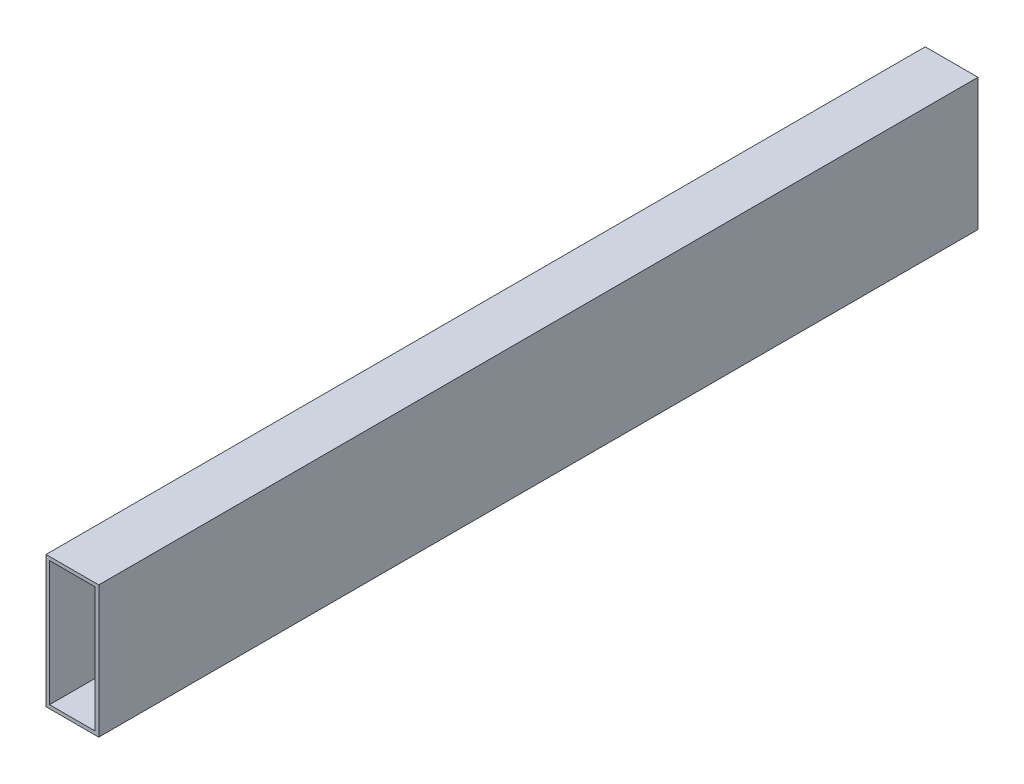
ISO-10303-21;
HEADER;
FILE_DESCRIPTION(('STEP AP214'),'2;1');
FILE_NAME('part.step','',(''),(''),'','','');
FILE_SCHEMA(('AUTOMOTIVE_DESIGN { 1 0 10303 214 1 1 1 1 }'));
ENDSEC;
DATA;
#1=APPLICATION_CONTEXT('core data for automotive mechanical design processes');
#2=APPLICATION_PROTOCOL_DEFINITION('international standard','automotive_design',2000,#1);
#3=PRODUCT_CONTEXT('',#1,'mechanical');
#4=PRODUCT('Part','Part','',(#3));
#5=PRODUCT_RELATED_PRODUCT_CATEGORY('part','',(#4));
#6=PRODUCT_DEFINITION_FORMATION('','',#4);
#7=PRODUCT_DEFINITION_CONTEXT('part definition',#1,'design');
#8=PRODUCT_DEFINITION('design','',#6,#7);
#9=PRODUCT_DEFINITION_SHAPE('','',#8);
#10=(LENGTH_UNIT() NAMED_UNIT(*) SI_UNIT(.MILLI.,.METRE.));
#11=(NAMED_UNIT(*) PLANE_ANGLE_UNIT() SI_UNIT($,.RADIAN.));
#12=(NAMED_UNIT(*) SI_UNIT($,.STERADIAN.) SOLID_ANGLE_UNIT());
#13=UNCERTAINTY_MEASURE_WITH_UNIT(LENGTH_MEASURE(1.E-05),#10,'distance_accuracy_value','');
#14=(GEOMETRIC_REPRESENTATION_CONTEXT(3) GLOBAL_UNCERTAINTY_ASSIGNED_CONTEXT((#13)) GLOBAL_UNIT_ASSIGNED_CONTEXT((#10,
#11,#12)) REPRESENTATION_CONTEXT('',''));
#15=CARTESIAN_POINT('',(0.,0.,0.));
#16=DIRECTION('',(0.,0.,1.));
#17=DIRECTION('',(1.,0.,0.));
#18=AXIS2_PLACEMENT_3D('',#15,#16,#17);
#19=CARTESIAN_POINT('',(-30.,75.,500.));
#20=DIRECTION('',(1.,0.,0.));
#21=DIRECTION('',(0.,0.,-1.));
#22=AXIS2_PLACEMENT_3D('',#19,#20,#21);
#23=PLANE('',#22);
#24=DIRECTION('',(0.,0.,-1.));
#25=VECTOR('',#24,1.);
#26=CARTESIAN_POINT('',(-30.,-75.,500.));
#27=LINE('',#26,#25);
#28=CARTESIAN_POINT('',(-30.,-75.,500.));
#29=VERTEX_POINT('',#28);
#30=CARTESIAN_POINT('',(-30.,-75.,-500.));
#31=VERTEX_POINT('',#30);
#32=EDGE_CURVE('E96',#29,#31,#27,.T.);
#33=ORIENTED_EDGE('',*,*,#32,.F.);
#34=DIRECTION('',(0.,-1.,0.));
#35=VECTOR('',#34,1.);
#36=CARTESIAN_POINT('',(-30.,75.,500.));
#37=LINE('',#36,#35);
#38=CARTESIAN_POINT('',(-30.,75.,500.));
#39=VERTEX_POINT('',#38);
#40=EDGE_CURVE('E85',#39,#29,#37,.T.);
#41=ORIENTED_EDGE('',*,*,#40,.F.);
#42=DIRECTION('',(0.,0.,-1.));
#43=VECTOR('',#42,1.);
#44=CARTESIAN_POINT('',(-30.,75.,500.));
#45=LINE('',#44,#43);
#46=CARTESIAN_POINT('',(-30.,75.,-500.));
#47=VERTEX_POINT('',#46);
#48=EDGE_CURVE('E101',#39,#47,#45,.T.);
#49=ORIENTED_EDGE('',*,*,#48,.T.);
#50=DIRECTION('',(0.,-1.,0.));
#51=VECTOR('',#50,1.);
#52=CARTESIAN_POINT('',(-30.,75.,-500.));
#53=LINE('',#52,#51);
#54=EDGE_CURVE('E97',#47,#31,#53,.T.);
#55=ORIENTED_EDGE('',*,*,#54,.T.);
#56=EDGE_LOOP('',(#33,#41,#49,#55));
#57=FACE_BOUND('',#56,.T.);
#58=ADVANCED_FACE('F33',(#57),#23,.F.);
#59=CARTESIAN_POINT('',(-30.,-75.,500.));
#60=DIRECTION('',(0.,1.,0.));
#61=DIRECTION('',(-1.,0.,0.));
#62=AXIS2_PLACEMENT_3D('',#59,#60,#61);
#63=PLANE('',#62);
#64=DIRECTION('',(0.,0.,-1.));
#65=VECTOR('',#64,1.);
#66=CARTESIAN_POINT('',(30.,-75.,500.));
#67=LINE('',#66,#65);
#68=CARTESIAN_POINT('',(30.,-75.,500.));
#69=VERTEX_POINT('',#68);
#70=CARTESIAN_POINT('',(30.,-75.,-500.));
#71=VERTEX_POINT('',#70);
#72=EDGE_CURVE('E100',#69,#71,#67,.T.);
#73=ORIENTED_EDGE('',*,*,#72,.F.);
#74=DIRECTION('',(1.,0.,0.));
#75=VECTOR('',#74,1.);
#76=CARTESIAN_POINT('',(-30.,-75.,500.));
#77=LINE('',#76,#75);
#78=EDGE_CURVE('E82',#29,#69,#77,.T.);
#79=ORIENTED_EDGE('',*,*,#78,.F.);
#80=ORIENTED_EDGE('',*,*,#32,.T.);
#81=DIRECTION('',(1.,0.,0.));
#82=VECTOR('',#81,1.);
#83=CARTESIAN_POINT('',(-30.,-75.,-500.));
#84=LINE('',#83,#82);
#85=EDGE_CURVE('E123',#31,#71,#84,.T.);
#86=ORIENTED_EDGE('',*,*,#85,.T.);
#87=EDGE_LOOP('',(#73,#79,#80,#86));
#88=FACE_BOUND('',#87,.T.);
#89=ADVANCED_FACE('F103',(#88),#63,.F.);
#90=CARTESIAN_POINT('',(30.,75.,500.));
#91=DIRECTION('',(-1.,0.,0.));
#92=DIRECTION('',(0.,-1.,0.));
#93=AXIS2_PLACEMENT_3D('',#90,#91,#92);
#94=PLANE('',#93);
#95=DIRECTION('',(0.,0.,-1.));
#96=VECTOR('',#95,1.);
#97=CARTESIAN_POINT('',(30.,75.,500.));
#98=LINE('',#97,#96);
#99=CARTESIAN_POINT('',(30.,75.,500.));
#100=VERTEX_POINT('',#99);
#101=CARTESIAN_POINT('',(30.,75.,-500.));
#102=VERTEX_POINT('',#101);
#103=EDGE_CURVE('E37',#100,#102,#98,.T.);
#104=ORIENTED_EDGE('',*,*,#103,.F.);
#105=DIRECTION('',(0.,1.,0.));
#106=VECTOR('',#105,1.);
#107=CARTESIAN_POINT('',(30.,75.,500.));
#108=LINE('',#107,#106);
#109=EDGE_CURVE('E106',#69,#100,#108,.T.);
#110=ORIENTED_EDGE('',*,*,#109,.F.);
#111=ORIENTED_EDGE('',*,*,#72,.T.);
#112=DIRECTION('',(0.,1.,0.));
#113=VECTOR('',#112,1.);
#114=CARTESIAN_POINT('',(30.,75.,-500.));
#115=LINE('',#114,#113);
#116=EDGE_CURVE('E110',#71,#102,#115,.T.);
#117=ORIENTED_EDGE('',*,*,#116,.T.);
#118=EDGE_LOOP('',(#104,#110,#111,#117));
#119=FACE_BOUND('',#118,.T.);
#120=ADVANCED_FACE('F121',(#119),#94,.F.);
#121=CARTESIAN_POINT('',(-30.,75.,500.));
#122=DIRECTION('',(0.,-1.,0.));
#123=DIRECTION('',(1.,0.,0.));
#124=AXIS2_PLACEMENT_3D('',#121,#122,#123);
#125=PLANE('',#124);
#126=DIRECTION('',(-1.,0.,0.));
#127=VECTOR('',#126,1.);
#128=CARTESIAN_POINT('',(-30.,75.,-500.));
#129=LINE('',#128,#127);
#130=EDGE_CURVE('E120',#102,#47,#129,.T.);
#131=ORIENTED_EDGE('',*,*,#130,.T.);
#132=ORIENTED_EDGE('',*,*,#48,.F.);
#133=DIRECTION('',(-1.,0.,0.));
#134=VECTOR('',#133,1.);
#135=CARTESIAN_POINT('',(-30.,75.,500.));
#136=LINE('',#135,#134);
#137=EDGE_CURVE('E89',#100,#39,#136,.T.);
#138=ORIENTED_EDGE('',*,*,#137,.F.);
#139=ORIENTED_EDGE('',*,*,#103,.T.);
#140=EDGE_LOOP('',(#131,#132,#138,#139));
#141=FACE_BOUND('',#140,.T.);
#142=ADVANCED_FACE('F35',(#141),#125,.F.);
#143=CARTESIAN_POINT('',(0.,0.,500.));
#144=DIRECTION('',(0.,0.,1.));
#145=DIRECTION('',(1.,0.,0.));
#146=AXIS2_PLACEMENT_3D('',#143,#144,#145);
#147=PLANE('',#146);
#148=DIRECTION('',(0.,-1.,0.));
#149=VECTOR('',#148,1.);
#150=CARTESIAN_POINT('',(-26.,71.,500.));
#151=LINE('',#150,#149);
#152=CARTESIAN_POINT('',(-26.,-71.,500.));
#153=VERTEX_POINT('',#152);
#154=CARTESIAN_POINT('',(-26.,71.,500.));
#155=VERTEX_POINT('',#154);
#156=EDGE_CURVE('E128',#153,#155,#151,.F.);
#157=ORIENTED_EDGE('',*,*,#156,.T.);
#158=DIRECTION('',(-1.,0.,0.));
#159=VECTOR('',#158,1.);
#160=CARTESIAN_POINT('',(-26.,71.,500.));
#161=LINE('',#160,#159);
#162=CARTESIAN_POINT('',(26.,71.,500.));
#163=VERTEX_POINT('',#162);
#164=EDGE_CURVE('E124',#155,#163,#161,.F.);
#165=ORIENTED_EDGE('',*,*,#164,.T.);
#166=DIRECTION('',(0.,1.,0.));
#167=VECTOR('',#166,1.);
#168=CARTESIAN_POINT('',(26.,71.,500.));
#169=LINE('',#168,#167);
#170=CARTESIAN_POINT('',(26.,-71.,500.));
#171=VERTEX_POINT('',#170);
#172=EDGE_CURVE('E142',#163,#171,#169,.F.);
#173=ORIENTED_EDGE('',*,*,#172,.T.);
#174=DIRECTION('',(1.,0.,0.));
#175=VECTOR('',#174,1.);
#176=CARTESIAN_POINT('',(-26.,-71.,500.));
#177=LINE('',#176,#175);
#178=EDGE_CURVE('E132',#171,#153,#177,.F.);
#179=ORIENTED_EDGE('',*,*,#178,.T.);
#180=EDGE_LOOP('',(#157,#165,#173,#179));
#181=FACE_BOUND('',#180,.T.);
#182=ORIENTED_EDGE('',*,*,#40,.T.);
#183=ORIENTED_EDGE('',*,*,#78,.T.);
#184=ORIENTED_EDGE('',*,*,#109,.T.);
#185=ORIENTED_EDGE('',*,*,#137,.T.);
#186=EDGE_LOOP('',(#182,#183,#184,#185));
#187=FACE_BOUND('',#186,.T.);
#188=ADVANCED_FACE('F87',(#181,#187),#147,.T.);
#189=CARTESIAN_POINT('',(0.,0.,-500.));
#190=DIRECTION('',(0.,0.,1.));
#191=DIRECTION('',(1.,0.,0.));
#192=AXIS2_PLACEMENT_3D('',#189,#190,#191);
#193=PLANE('',#192);
#194=DIRECTION('',(0.,-1.,0.));
#195=VECTOR('',#194,1.);
#196=CARTESIAN_POINT('',(-26.,71.,-500.));
#197=LINE('',#196,#195);
#198=CARTESIAN_POINT('',(-26.,-71.,-500.));
#199=VERTEX_POINT('',#198);
#200=CARTESIAN_POINT('',(-26.,71.,-500.));
#201=VERTEX_POINT('',#200);
#202=EDGE_CURVE('E11',#199,#201,#197,.F.);
#203=ORIENTED_EDGE('',*,*,#202,.F.);
#204=DIRECTION('',(1.,0.,0.));
#205=VECTOR('',#204,1.);
#206=CARTESIAN_POINT('',(-26.,-71.,-500.));
#207=LINE('',#206,#205);
#208=CARTESIAN_POINT('',(26.,-71.,-500.));
#209=VERTEX_POINT('',#208);
#210=EDGE_CURVE('E43',#209,#199,#207,.F.);
#211=ORIENTED_EDGE('',*,*,#210,.F.);
#212=DIRECTION('',(0.,1.,0.));
#213=VECTOR('',#212,1.);
#214=CARTESIAN_POINT('',(26.,71.,-500.));
#215=LINE('',#214,#213);
#216=CARTESIAN_POINT('',(26.,71.,-500.));
#217=VERTEX_POINT('',#216);
#218=EDGE_CURVE('E139',#217,#209,#215,.F.);
#219=ORIENTED_EDGE('',*,*,#218,.F.);
#220=DIRECTION('',(-1.,0.,0.));
#221=VECTOR('',#220,1.);
#222=CARTESIAN_POINT('',(-26.,71.,-500.));
#223=LINE('',#222,#221);
#224=EDGE_CURVE('E136',#201,#217,#223,.F.);
#225=ORIENTED_EDGE('',*,*,#224,.F.);
#226=EDGE_LOOP('',(#203,#211,#219,#225));
#227=FACE_BOUND('',#226,.T.);
#228=ORIENTED_EDGE('',*,*,#54,.F.);
#229=ORIENTED_EDGE('',*,*,#130,.F.);
#230=ORIENTED_EDGE('',*,*,#116,.F.);
#231=ORIENTED_EDGE('',*,*,#85,.F.);
#232=EDGE_LOOP('',(#228,#229,#230,#231));
#233=FACE_BOUND('',#232,.T.);
#234=ADVANCED_FACE('F189',(#227,#233),#193,.F.);
#235=CARTESIAN_POINT('',(-26.,71.,500.));
#236=DIRECTION('',(0.,1.,0.));
#237=DIRECTION('',(-1.,0.,0.));
#238=AXIS2_PLACEMENT_3D('',#235,#236,#237);
#239=PLANE('',#238);
#240=DIRECTION('',(0.,0.,-1.));
#241=VECTOR('',#240,1.);
#242=CARTESIAN_POINT('',(26.,71.,500.));
#243=LINE('',#242,#241);
#244=EDGE_CURVE('E144',#163,#217,#243,.T.);
#245=ORIENTED_EDGE('',*,*,#244,.F.);
#246=ORIENTED_EDGE('',*,*,#164,.F.);
#247=DIRECTION('',(0.,0.,-1.));
#248=VECTOR('',#247,1.);
#249=CARTESIAN_POINT('',(-26.,71.,500.));
#250=LINE('',#249,#248);
#251=EDGE_CURVE('E131',#155,#201,#250,.T.);
#252=ORIENTED_EDGE('',*,*,#251,.T.);
#253=ORIENTED_EDGE('',*,*,#224,.T.);
#254=EDGE_LOOP('',(#245,#246,#252,#253));
#255=FACE_BOUND('',#254,.T.);
#256=ADVANCED_FACE('F166',(#255),#239,.F.);
#257=CARTESIAN_POINT('',(26.,71.,500.));
#258=DIRECTION('',(1.,0.,0.));
#259=DIRECTION('',(0.,0.,-1.));
#260=AXIS2_PLACEMENT_3D('',#257,#258,#259);
#261=PLANE('',#260);
#262=DIRECTION('',(0.,0.,-1.));
#263=VECTOR('',#262,1.);
#264=CARTESIAN_POINT('',(26.,-71.,500.));
#265=LINE('',#264,#263);
#266=EDGE_CURVE('E137',#171,#209,#265,.T.);
#267=ORIENTED_EDGE('',*,*,#266,.F.);
#268=ORIENTED_EDGE('',*,*,#172,.F.);
#269=ORIENTED_EDGE('',*,*,#244,.T.);
#270=ORIENTED_EDGE('',*,*,#218,.T.);
#271=EDGE_LOOP('',(#267,#268,#269,#270));
#272=FACE_BOUND('',#271,.T.);
#273=ADVANCED_FACE('F170',(#272),#261,.F.);
#274=CARTESIAN_POINT('',(-26.,-71.,500.));
#275=DIRECTION('',(0.,-1.,0.));
#276=DIRECTION('',(1.,0.,0.));
#277=AXIS2_PLACEMENT_3D('',#274,#275,#276);
#278=PLANE('',#277);
#279=DIRECTION('',(0.,0.,-1.));
#280=VECTOR('',#279,1.);
#281=CARTESIAN_POINT('',(-26.,-71.,500.));
#282=LINE('',#281,#280);
#283=EDGE_CURVE('E133',#153,#199,#282,.T.);
#284=ORIENTED_EDGE('',*,*,#283,.F.);
#285=ORIENTED_EDGE('',*,*,#178,.F.);
#286=ORIENTED_EDGE('',*,*,#266,.T.);
#287=ORIENTED_EDGE('',*,*,#210,.T.);
#288=EDGE_LOOP('',(#284,#285,#286,#287));
#289=FACE_BOUND('',#288,.T.);
#290=ADVANCED_FACE('F178',(#289),#278,.F.);
#291=CARTESIAN_POINT('',(-26.,71.,500.));
#292=DIRECTION('',(-1.,0.,0.));
#293=DIRECTION('',(0.,0.,1.));
#294=AXIS2_PLACEMENT_3D('',#291,#292,#293);
#295=PLANE('',#294);
#296=ORIENTED_EDGE('',*,*,#202,.T.);
#297=ORIENTED_EDGE('',*,*,#251,.F.);
#298=ORIENTED_EDGE('',*,*,#156,.F.);
#299=ORIENTED_EDGE('',*,*,#283,.T.);
#300=EDGE_LOOP('',(#296,#297,#298,#299));
#301=FACE_BOUND('',#300,.T.);
#302=ADVANCED_FACE('F177',(#301),#295,.F.);
#303=CLOSED_SHELL('',(#58,#89,#120,#142,#188,#234,#256,#273,#290,#302));
#304=MANIFOLD_SOLID_BREP('B2',#303);
#305=ADVANCED_BREP_SHAPE_REPRESENTATION('',(#18,#304),#14);
#306=SHAPE_DEFINITION_REPRESENTATION(#9,#305);
ENDSEC;
END-ISO-10303-21;
